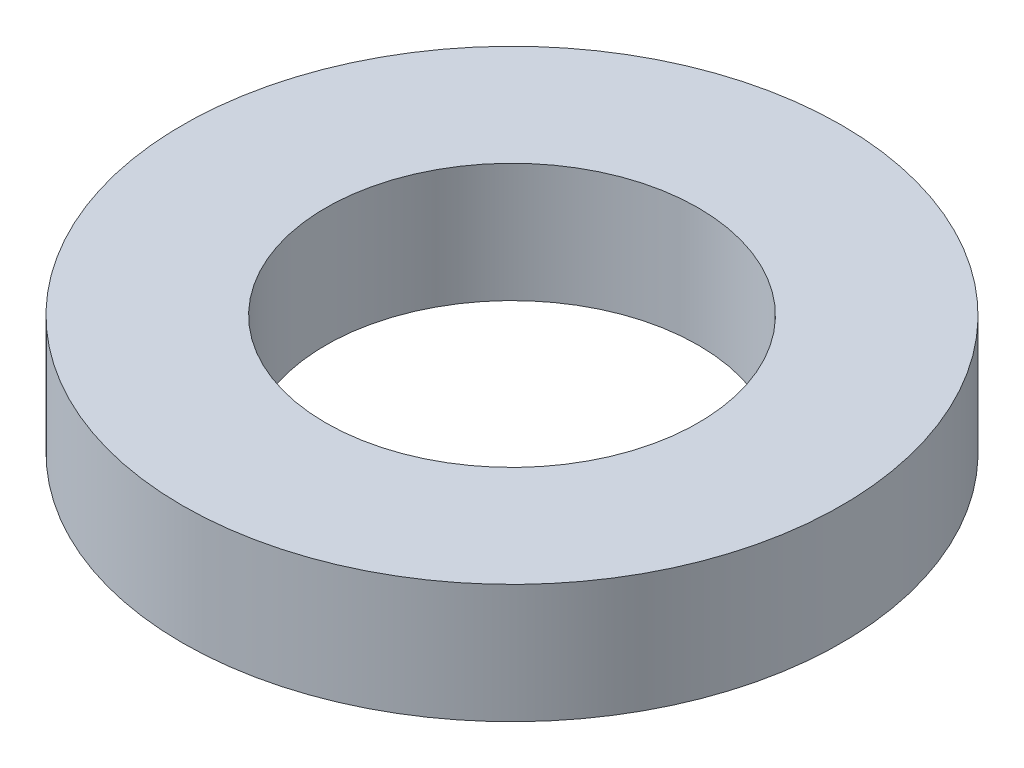
ISO-10303-21;
HEADER;
FILE_DESCRIPTION(('STEP AP214'),'2;1');
FILE_NAME('part.step','',(''),(''),'','','');
FILE_SCHEMA(('AUTOMOTIVE_DESIGN { 1 0 10303 214 1 1 1 1 }'));
ENDSEC;
DATA;
#1=APPLICATION_CONTEXT('core data for automotive mechanical design processes');
#2=APPLICATION_PROTOCOL_DEFINITION('international standard','automotive_design',2000,#1);
#3=PRODUCT_CONTEXT('',#1,'mechanical');
#4=PRODUCT('Part','Part','',(#3));
#5=PRODUCT_RELATED_PRODUCT_CATEGORY('part','',(#4));
#6=PRODUCT_DEFINITION_FORMATION('','',#4);
#7=PRODUCT_DEFINITION_CONTEXT('part definition',#1,'design');
#8=PRODUCT_DEFINITION('design','',#6,#7);
#9=PRODUCT_DEFINITION_SHAPE('','',#8);
#10=(LENGTH_UNIT() NAMED_UNIT(*) SI_UNIT(.MILLI.,.METRE.));
#11=(NAMED_UNIT(*) PLANE_ANGLE_UNIT() SI_UNIT($,.RADIAN.));
#12=(NAMED_UNIT(*) SI_UNIT($,.STERADIAN.) SOLID_ANGLE_UNIT());
#13=UNCERTAINTY_MEASURE_WITH_UNIT(LENGTH_MEASURE(1.E-05),#10,'distance_accuracy_value','');
#14=(GEOMETRIC_REPRESENTATION_CONTEXT(3) GLOBAL_UNCERTAINTY_ASSIGNED_CONTEXT((#13)) GLOBAL_UNIT_ASSIGNED_CONTEXT((#10,
#11,#12)) REPRESENTATION_CONTEXT('',''));
#15=CARTESIAN_POINT('',(0.,0.,0.));
#16=DIRECTION('',(0.,0.,1.));
#17=DIRECTION('',(1.,0.,0.));
#18=AXIS2_PLACEMENT_3D('',#15,#16,#17);
#19=CARTESIAN_POINT('',(0.,2.1082,0.));
#20=DIRECTION('',(0.,1.,0.));
#21=DIRECTION('',(0.,0.,1.));
#22=AXIS2_PLACEMENT_3D('',#19,#20,#21);
#23=PLANE('',#22);
#24=CARTESIAN_POINT('',(0.,2.1082,0.));
#25=DIRECTION('',(0.,1.,0.));
#26=DIRECTION('',(0.,0.,1.));
#27=AXIS2_PLACEMENT_3D('',#24,#25,#26);
#28=CIRCLE('',#27,5.842);
#29=CARTESIAN_POINT('',(0.,2.1082,5.842));
#30=VERTEX_POINT('',#29);
#31=EDGE_CURVE('E10',#30,#30,#28,.T.);
#32=ORIENTED_EDGE('',*,*,#31,.T.);
#33=EDGE_LOOP('',(#32));
#34=FACE_BOUND('',#33,.T.);
#35=CARTESIAN_POINT('',(0.,2.1082,0.));
#36=DIRECTION('',(0.,1.,0.));
#37=DIRECTION('',(0.,0.,1.));
#38=AXIS2_PLACEMENT_3D('',#35,#36,#37);
#39=CIRCLE('',#38,3.302);
#40=CARTESIAN_POINT('',(0.,2.1082,3.302));
#41=VERTEX_POINT('',#40);
#42=EDGE_CURVE('E45',#41,#41,#39,.T.);
#43=ORIENTED_EDGE('',*,*,#42,.F.);
#44=EDGE_LOOP('',(#43));
#45=FACE_BOUND('',#44,.T.);
#46=ADVANCED_FACE('F34',(#34,#45),#23,.T.);
#47=CARTESIAN_POINT('',(0.,0.,0.));
#48=DIRECTION('',(0.,1.,0.));
#49=DIRECTION('',(0.,0.,1.));
#50=AXIS2_PLACEMENT_3D('',#47,#48,#49);
#51=PLANE('',#50);
#52=CARTESIAN_POINT('',(0.,0.,0.));
#53=DIRECTION('',(0.,1.,0.));
#54=DIRECTION('',(0.,0.,1.));
#55=AXIS2_PLACEMENT_3D('',#52,#53,#54);
#56=CIRCLE('',#55,5.842);
#57=CARTESIAN_POINT('',(0.,0.,5.842));
#58=VERTEX_POINT('',#57);
#59=EDGE_CURVE('E38',#58,#58,#56,.T.);
#60=ORIENTED_EDGE('',*,*,#59,.F.);
#61=EDGE_LOOP('',(#60));
#62=FACE_BOUND('',#61,.T.);
#63=CARTESIAN_POINT('',(0.,0.,0.));
#64=DIRECTION('',(0.,1.,0.));
#65=DIRECTION('',(0.,0.,1.));
#66=AXIS2_PLACEMENT_3D('',#63,#64,#65);
#67=CIRCLE('',#66,3.302);
#68=CARTESIAN_POINT('',(0.,0.,3.302));
#69=VERTEX_POINT('',#68);
#70=EDGE_CURVE('E47',#69,#69,#67,.T.);
#71=ORIENTED_EDGE('',*,*,#70,.T.);
#72=EDGE_LOOP('',(#71));
#73=FACE_BOUND('',#72,.T.);
#74=ADVANCED_FACE('F57',(#62,#73),#51,.F.);
#75=CARTESIAN_POINT('',(0.,2.1082,0.));
#76=DIRECTION('',(0.,-1.,0.));
#77=DIRECTION('',(0.,0.,-1.));
#78=AXIS2_PLACEMENT_3D('',#75,#76,#77);
#79=CYLINDRICAL_SURFACE('',#78,5.842);
#80=ORIENTED_EDGE('',*,*,#31,.F.);
#81=EDGE_LOOP('',(#80));
#82=FACE_BOUND('',#81,.T.);
#83=ORIENTED_EDGE('',*,*,#59,.T.);
#84=EDGE_LOOP('',(#83));
#85=FACE_BOUND('',#84,.T.);
#86=ADVANCED_FACE('F36',(#82,#85),#79,.T.);
#87=CARTESIAN_POINT('',(0.,2.1082,0.));
#88=DIRECTION('',(0.,-1.,0.));
#89=DIRECTION('',(0.,0.,-1.));
#90=AXIS2_PLACEMENT_3D('',#87,#88,#89);
#91=CYLINDRICAL_SURFACE('',#90,3.302);
#92=ORIENTED_EDGE('',*,*,#42,.T.);
#93=EDGE_LOOP('',(#92));
#94=FACE_BOUND('',#93,.T.);
#95=ORIENTED_EDGE('',*,*,#70,.F.);
#96=EDGE_LOOP('',(#95));
#97=FACE_BOUND('',#96,.T.);
#98=ADVANCED_FACE('F53',(#94,#97),#91,.F.);
#99=CLOSED_SHELL('',(#46,#74,#86,#98));
#100=MANIFOLD_SOLID_BREP('B2',#99);
#101=ADVANCED_BREP_SHAPE_REPRESENTATION('',(#18,#100),#14);
#102=SHAPE_DEFINITION_REPRESENTATION(#9,#101);
ENDSEC;
END-ISO-10303-21;
